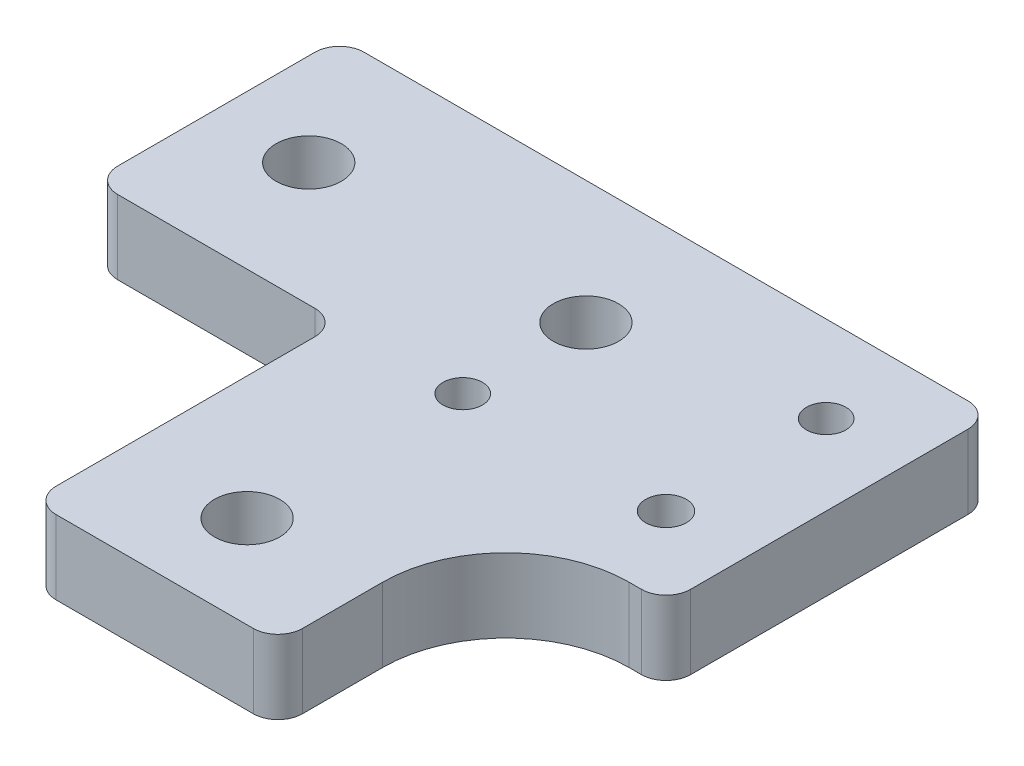
ISO-10303-21;
HEADER;
FILE_DESCRIPTION(('STEP AP214'),'2;1');
FILE_NAME('part.step','',(''),(''),'','','');
FILE_SCHEMA(('AUTOMOTIVE_DESIGN { 1 0 10303 214 1 1 1 1 }'));
ENDSEC;
DATA;
#1=APPLICATION_CONTEXT('core data for automotive mechanical design processes');
#2=APPLICATION_PROTOCOL_DEFINITION('international standard','automotive_design',2000,#1);
#3=PRODUCT_CONTEXT('',#1,'mechanical');
#4=PRODUCT('Part','Part','',(#3));
#5=PRODUCT_RELATED_PRODUCT_CATEGORY('part','',(#4));
#6=PRODUCT_DEFINITION_FORMATION('','',#4);
#7=PRODUCT_DEFINITION_CONTEXT('part definition',#1,'design');
#8=PRODUCT_DEFINITION('design','',#6,#7);
#9=PRODUCT_DEFINITION_SHAPE('','',#8);
#10=(LENGTH_UNIT() NAMED_UNIT(*) SI_UNIT(.MILLI.,.METRE.));
#11=(NAMED_UNIT(*) PLANE_ANGLE_UNIT() SI_UNIT($,.RADIAN.));
#12=(NAMED_UNIT(*) SI_UNIT($,.STERADIAN.) SOLID_ANGLE_UNIT());
#13=UNCERTAINTY_MEASURE_WITH_UNIT(LENGTH_MEASURE(1.E-05),#10,'distance_accuracy_value','');
#14=(GEOMETRIC_REPRESENTATION_CONTEXT(3) GLOBAL_UNCERTAINTY_ASSIGNED_CONTEXT((#13)) GLOBAL_UNIT_ASSIGNED_CONTEXT((#10,
#11,#12)) REPRESENTATION_CONTEXT('',''));
#15=CARTESIAN_POINT('',(0.,0.,0.));
#16=DIRECTION('',(0.,0.,1.));
#17=DIRECTION('',(1.,0.,0.));
#18=AXIS2_PLACEMENT_3D('',#15,#16,#17);
#19=CARTESIAN_POINT('',(50.,0.,-8.53727598566309));
#20=DIRECTION('',(0.,1.,0.));
#21=DIRECTION('',(0.,0.,1.));
#22=AXIS2_PLACEMENT_3D('',#19,#20,#21);
#23=PLANE('',#22);
#24=CARTESIAN_POINT('',(46.5,0.,-25.0372759856631));
#25=DIRECTION('',(0.,-1.,0.));
#26=DIRECTION('',(0.,0.,-1.));
#27=AXIS2_PLACEMENT_3D('',#24,#25,#26);
#28=CIRCLE('',#27,1.64999999999999);
#29=CARTESIAN_POINT('',(46.5,0.,-26.6872759856631));
#30=VERTEX_POINT('',#29);
#31=EDGE_CURVE('E431',#30,#30,#28,.T.);
#32=ORIENTED_EDGE('',*,*,#31,.F.);
#33=EDGE_LOOP('',(#32));
#34=FACE_BOUND('',#33,.T.);
#35=CARTESIAN_POINT('',(30.,0.,-25.0372759856631));
#36=DIRECTION('',(0.,-1.,0.));
#37=DIRECTION('',(0.,0.,-1.));
#38=AXIS2_PLACEMENT_3D('',#35,#36,#37);
#39=CIRCLE('',#38,1.6);
#40=CARTESIAN_POINT('',(30.,0.,-26.6372759856631));
#41=VERTEX_POINT('',#40);
#42=EDGE_CURVE('E435',#41,#41,#39,.T.);
#43=ORIENTED_EDGE('',*,*,#42,.F.);
#44=EDGE_LOOP('',(#43));
#45=FACE_BOUND('',#44,.T.);
#46=CARTESIAN_POINT('',(46.5,0.,-38.0372759856631));
#47=DIRECTION('',(0.,-1.,0.));
#48=DIRECTION('',(0.,0.,-1.));
#49=AXIS2_PLACEMENT_3D('',#46,#47,#48);
#50=CIRCLE('',#49,1.6);
#51=CARTESIAN_POINT('',(46.5,0.,-39.6372759856631));
#52=VERTEX_POINT('',#51);
#53=EDGE_CURVE('E445',#52,#52,#50,.T.);
#54=ORIENTED_EDGE('',*,*,#53,.F.);
#55=EDGE_LOOP('',(#54));
#56=FACE_BOUND('',#55,.T.);
#57=CARTESIAN_POINT('',(7.5,0.,-35.0372759856631));
#58=DIRECTION('',(0.,-1.,0.));
#59=DIRECTION('',(0.,0.,-1.));
#60=AXIS2_PLACEMENT_3D('',#57,#58,#59);
#61=CIRCLE('',#60,2.64999999999999);
#62=CARTESIAN_POINT('',(7.5,0.,-37.6872759856631));
#63=VERTEX_POINT('',#62);
#64=EDGE_CURVE('E453',#63,#63,#61,.T.);
#65=ORIENTED_EDGE('',*,*,#64,.F.);
#66=EDGE_LOOP('',(#65));
#67=FACE_BOUND('',#66,.T.);
#68=CARTESIAN_POINT('',(30.,0.,-35.0372759856631));
#69=DIRECTION('',(0.,-1.,0.));
#70=DIRECTION('',(0.,0.,-1.));
#71=AXIS2_PLACEMENT_3D('',#68,#69,#70);
#72=CIRCLE('',#71,2.64999999999999);
#73=CARTESIAN_POINT('',(30.,0.,-37.6872759856631));
#74=VERTEX_POINT('',#73);
#75=EDGE_CURVE('E461',#74,#74,#72,.T.);
#76=ORIENTED_EDGE('',*,*,#75,.F.);
#77=EDGE_LOOP('',(#76));
#78=FACE_BOUND('',#77,.T.);
#79=CARTESIAN_POINT('',(50.,0.,-8.53727598566309));
#80=DIRECTION('',(0.,-1.,0.));
#81=DIRECTION('',(0.,0.,1.));
#82=AXIS2_PLACEMENT_3D('',#79,#80,#81);
#83=CIRCLE('',#82,10.);
#84=CARTESIAN_POINT('',(40.,0.,-8.53727598566301));
#85=VERTEX_POINT('',#84);
#86=CARTESIAN_POINT('',(50.0000000000001,0.,-18.5372759856631));
#87=VERTEX_POINT('',#86);
#88=EDGE_CURVE('E223',#85,#87,#83,.T.);
#89=ORIENTED_EDGE('',*,*,#88,.F.);
#90=DIRECTION('',(0.,0.,-1.));
#91=VECTOR('',#90,1.);
#92=CARTESIAN_POINT('',(40.,0.,-2.0372759856631));
#93=LINE('',#92,#91);
#94=CARTESIAN_POINT('',(40.,0.,-2.0372759856631));
#95=VERTEX_POINT('',#94);
#96=EDGE_CURVE('E141',#95,#85,#93,.T.);
#97=ORIENTED_EDGE('',*,*,#96,.F.);
#98=CARTESIAN_POINT('',(38.,0.,-2.03727598566308));
#99=DIRECTION('',(0.,1.,0.));
#100=DIRECTION('',(0.,0.,1.));
#101=AXIS2_PLACEMENT_3D('',#98,#99,#100);
#102=CIRCLE('',#101,2.);
#103=CARTESIAN_POINT('',(38.,0.,-0.0372759856630822));
#104=VERTEX_POINT('',#103);
#105=EDGE_CURVE('E133',#104,#95,#102,.T.);
#106=ORIENTED_EDGE('',*,*,#105,.F.);
#107=DIRECTION('',(1.,0.,0.));
#108=VECTOR('',#107,1.);
#109=CARTESIAN_POINT('',(22.,0.,-0.0372759856630822));
#110=LINE('',#109,#108);
#111=CARTESIAN_POINT('',(22.,0.,-0.0372759856630826));
#112=VERTEX_POINT('',#111);
#113=EDGE_CURVE('E210',#112,#104,#110,.T.);
#114=ORIENTED_EDGE('',*,*,#113,.F.);
#115=CARTESIAN_POINT('',(22.,0.,-2.03727598566308));
#116=DIRECTION('',(0.,1.,0.));
#117=DIRECTION('',(0.,0.,-1.));
#118=AXIS2_PLACEMENT_3D('',#115,#116,#117);
#119=CIRCLE('',#118,2.);
#120=CARTESIAN_POINT('',(20.,0.,-2.0372759856631));
#121=VERTEX_POINT('',#120);
#122=EDGE_CURVE('E261',#121,#112,#119,.T.);
#123=ORIENTED_EDGE('',*,*,#122,.F.);
#124=DIRECTION('',(0.,0.,1.));
#125=VECTOR('',#124,1.);
#126=CARTESIAN_POINT('',(20.,0.,-2.0372759856631));
#127=LINE('',#126,#125);
#128=CARTESIAN_POINT('',(20.,0.,-23.0372759856631));
#129=VERTEX_POINT('',#128);
#130=EDGE_CURVE('E258',#129,#121,#127,.T.);
#131=ORIENTED_EDGE('',*,*,#130,.F.);
#132=CARTESIAN_POINT('',(18.,0.,-23.0372759856631));
#133=DIRECTION('',(0.,-1.,0.));
#134=DIRECTION('',(0.,0.,-1.));
#135=AXIS2_PLACEMENT_3D('',#132,#133,#134);
#136=CIRCLE('',#135,2.);
#137=CARTESIAN_POINT('',(18.,0.,-25.0372759856631));
#138=VERTEX_POINT('',#137);
#139=EDGE_CURVE('E255',#138,#129,#136,.T.);
#140=ORIENTED_EDGE('',*,*,#139,.F.);
#141=DIRECTION('',(1.,0.,0.));
#142=VECTOR('',#141,1.);
#143=CARTESIAN_POINT('',(2.00000000000003,0.,-25.0372759856631));
#144=LINE('',#143,#142);
#145=CARTESIAN_POINT('',(2.00000000000001,0.,-25.0372759856631));
#146=VERTEX_POINT('',#145);
#147=EDGE_CURVE('E252',#146,#138,#144,.T.);
#148=ORIENTED_EDGE('',*,*,#147,.F.);
#149=CARTESIAN_POINT('',(2.00000000000001,0.,-27.0372759856631));
#150=DIRECTION('',(0.,1.,0.));
#151=DIRECTION('',(0.,0.,1.));
#152=AXIS2_PLACEMENT_3D('',#149,#150,#151);
#153=CIRCLE('',#152,2.);
#154=CARTESIAN_POINT('',(0.,0.,-27.0372759856631));
#155=VERTEX_POINT('',#154);
#156=EDGE_CURVE('E249',#155,#146,#153,.T.);
#157=ORIENTED_EDGE('',*,*,#156,.F.);
#158=DIRECTION('',(0.,0.,1.));
#159=VECTOR('',#158,1.);
#160=CARTESIAN_POINT('',(0.,0.,-27.0372759856631));
#161=LINE('',#160,#159);
#162=CARTESIAN_POINT('',(0.,0.,-43.0372759856631));
#163=VERTEX_POINT('',#162);
#164=EDGE_CURVE('E246',#163,#155,#161,.T.);
#165=ORIENTED_EDGE('',*,*,#164,.F.);
#166=CARTESIAN_POINT('',(2.00000000000001,0.,-43.0372759856631));
#167=DIRECTION('',(0.,1.,0.));
#168=DIRECTION('',(0.,0.,-1.));
#169=AXIS2_PLACEMENT_3D('',#166,#167,#168);
#170=CIRCLE('',#169,2.);
#171=CARTESIAN_POINT('',(2.00000000000003,0.,-45.0372759856631));
#172=VERTEX_POINT('',#171);
#173=EDGE_CURVE('E243',#172,#163,#170,.T.);
#174=ORIENTED_EDGE('',*,*,#173,.F.);
#175=DIRECTION('',(-1.,0.,0.));
#176=VECTOR('',#175,1.);
#177=CARTESIAN_POINT('',(2.00000000000003,0.,-45.0372759856631));
#178=LINE('',#177,#176);
#179=CARTESIAN_POINT('',(51.,0.,-45.0372759856631));
#180=VERTEX_POINT('',#179);
#181=EDGE_CURVE('E240',#180,#172,#178,.T.);
#182=ORIENTED_EDGE('',*,*,#181,.F.);
#183=CARTESIAN_POINT('',(51.,0.,-43.0372759856631));
#184=DIRECTION('',(0.,1.,0.));
#185=DIRECTION('',(0.,0.,-1.));
#186=AXIS2_PLACEMENT_3D('',#183,#184,#185);
#187=CIRCLE('',#186,2.);
#188=CARTESIAN_POINT('',(53.,0.,-43.0372759856631));
#189=VERTEX_POINT('',#188);
#190=EDGE_CURVE('E237',#189,#180,#187,.T.);
#191=ORIENTED_EDGE('',*,*,#190,.F.);
#192=DIRECTION('',(0.,0.,-1.));
#193=VECTOR('',#192,1.);
#194=CARTESIAN_POINT('',(53.,0.,-20.5372759856631));
#195=LINE('',#194,#193);
#196=CARTESIAN_POINT('',(53.,0.,-20.5372759856631));
#197=VERTEX_POINT('',#196);
#198=EDGE_CURVE('E234',#197,#189,#195,.T.);
#199=ORIENTED_EDGE('',*,*,#198,.F.);
#200=CARTESIAN_POINT('',(51.,0.,-20.5372759856631));
#201=DIRECTION('',(0.,1.,0.));
#202=DIRECTION('',(0.,0.,-1.));
#203=AXIS2_PLACEMENT_3D('',#200,#201,#202);
#204=CIRCLE('',#203,2.);
#205=CARTESIAN_POINT('',(51.,0.,-18.5372759856631));
#206=VERTEX_POINT('',#205);
#207=EDGE_CURVE('E231',#206,#197,#204,.T.);
#208=ORIENTED_EDGE('',*,*,#207,.F.);
#209=DIRECTION('',(1.,0.,0.));
#210=VECTOR('',#209,1.);
#211=CARTESIAN_POINT('',(51.,0.,-18.5372759856631));
#212=LINE('',#211,#210);
#213=EDGE_CURVE('E227',#87,#206,#212,.T.);
#214=ORIENTED_EDGE('',*,*,#213,.F.);
#215=EDGE_LOOP('',(#89,#97,#106,#114,#123,#131,#140,#148,#157,#165,#174,#182,#191,#199,#208,#214));
#216=FACE_BOUND('',#215,.T.);
#217=CARTESIAN_POINT('',(30.,0.,-7.53727598566308));
#218=DIRECTION('',(0.,-1.,0.));
#219=DIRECTION('',(0.,0.,-1.));
#220=AXIS2_PLACEMENT_3D('',#217,#218,#219);
#221=CIRCLE('',#220,2.64999999999999);
#222=CARTESIAN_POINT('',(30.,0.,-10.1872759856631));
#223=VERTEX_POINT('',#222);
#224=EDGE_CURVE('E469',#223,#223,#221,.T.);
#225=ORIENTED_EDGE('',*,*,#224,.F.);
#226=EDGE_LOOP('',(#225));
#227=FACE_BOUND('',#226,.T.);
#228=ADVANCED_FACE('F47',(#34,#45,#56,#67,#78,#216,#227),#23,.F.);
#229=CARTESIAN_POINT('',(50.,6.,-8.53727598566309));
#230=DIRECTION('',(0.,-1.,0.));
#231=DIRECTION('',(0.,0.,-1.));
#232=AXIS2_PLACEMENT_3D('',#229,#230,#231);
#233=CYLINDRICAL_SURFACE('',#232,10.);
#234=ORIENTED_EDGE('',*,*,#88,.T.);
#235=DIRECTION('',(0.,-1.,0.));
#236=VECTOR('',#235,1.);
#237=CARTESIAN_POINT('',(50.0000000000001,6.,-18.5372759856631));
#238=LINE('',#237,#236);
#239=CARTESIAN_POINT('',(50.0000000000001,6.,-18.5372759856631));
#240=VERTEX_POINT('',#239);
#241=EDGE_CURVE('E11',#240,#87,#238,.T.);
#242=ORIENTED_EDGE('',*,*,#241,.F.);
#243=CARTESIAN_POINT('',(50.,6.,-8.53727598566309));
#244=DIRECTION('',(0.,-1.,0.));
#245=DIRECTION('',(0.,0.,1.));
#246=AXIS2_PLACEMENT_3D('',#243,#244,#245);
#247=CIRCLE('',#246,10.);
#248=CARTESIAN_POINT('',(40.,6.,-8.53727598566301));
#249=VERTEX_POINT('',#248);
#250=EDGE_CURVE('E270',#249,#240,#247,.T.);
#251=ORIENTED_EDGE('',*,*,#250,.F.);
#252=DIRECTION('',(0.,-1.,0.));
#253=VECTOR('',#252,1.);
#254=CARTESIAN_POINT('',(40.,6.,-8.53727598566301));
#255=LINE('',#254,#253);
#256=EDGE_CURVE('E219',#249,#85,#255,.T.);
#257=ORIENTED_EDGE('',*,*,#256,.T.);
#258=EDGE_LOOP('',(#234,#242,#251,#257));
#259=FACE_BOUND('',#258,.T.);
#260=ADVANCED_FACE('F49',(#259),#233,.F.);
#261=CARTESIAN_POINT('',(51.,6.,-18.5372759856631));
#262=DIRECTION('',(0.,0.,-1.));
#263=DIRECTION('',(-1.,0.,0.));
#264=AXIS2_PLACEMENT_3D('',#261,#262,#263);
#265=PLANE('',#264);
#266=ORIENTED_EDGE('',*,*,#213,.T.);
#267=DIRECTION('',(0.,-1.,0.));
#268=VECTOR('',#267,1.);
#269=CARTESIAN_POINT('',(51.,6.,-18.5372759856631));
#270=LINE('',#269,#268);
#271=CARTESIAN_POINT('',(51.,6.,-18.5372759856631));
#272=VERTEX_POINT('',#271);
#273=EDGE_CURVE('E57',#272,#206,#270,.T.);
#274=ORIENTED_EDGE('',*,*,#273,.F.);
#275=DIRECTION('',(1.,0.,0.));
#276=VECTOR('',#275,1.);
#277=CARTESIAN_POINT('',(51.,6.,-18.5372759856631));
#278=LINE('',#277,#276);
#279=EDGE_CURVE('E150',#240,#272,#278,.T.);
#280=ORIENTED_EDGE('',*,*,#279,.F.);
#281=ORIENTED_EDGE('',*,*,#241,.T.);
#282=EDGE_LOOP('',(#266,#274,#280,#281));
#283=FACE_BOUND('',#282,.T.);
#284=ADVANCED_FACE('F398',(#283),#265,.F.);
#285=CARTESIAN_POINT('',(51.,6.,-20.5372759856631));
#286=DIRECTION('',(0.,-1.,0.));
#287=DIRECTION('',(0.,0.,-1.));
#288=AXIS2_PLACEMENT_3D('',#285,#286,#287);
#289=CYLINDRICAL_SURFACE('',#288,2.);
#290=ORIENTED_EDGE('',*,*,#207,.T.);
#291=DIRECTION('',(0.,-1.,0.));
#292=VECTOR('',#291,1.);
#293=CARTESIAN_POINT('',(53.,6.,-20.5372759856631));
#294=LINE('',#293,#292);
#295=CARTESIAN_POINT('',(53.,6.,-20.5372759856631));
#296=VERTEX_POINT('',#295);
#297=EDGE_CURVE('E313',#296,#197,#294,.T.);
#298=ORIENTED_EDGE('',*,*,#297,.F.);
#299=CARTESIAN_POINT('',(51.,6.,-20.5372759856631));
#300=DIRECTION('',(0.,1.,0.));
#301=DIRECTION('',(0.,0.,-1.));
#302=AXIS2_PLACEMENT_3D('',#299,#300,#301);
#303=CIRCLE('',#302,2.);
#304=EDGE_CURVE('E323',#272,#296,#303,.T.);
#305=ORIENTED_EDGE('',*,*,#304,.F.);
#306=ORIENTED_EDGE('',*,*,#273,.T.);
#307=EDGE_LOOP('',(#290,#298,#305,#306));
#308=FACE_BOUND('',#307,.T.);
#309=ADVANCED_FACE('F321',(#308),#289,.T.);
#310=CARTESIAN_POINT('',(53.,6.,-20.5372759856631));
#311=DIRECTION('',(-1.,0.,0.));
#312=DIRECTION('',(0.,0.,1.));
#313=AXIS2_PLACEMENT_3D('',#310,#311,#312);
#314=PLANE('',#313);
#315=ORIENTED_EDGE('',*,*,#198,.T.);
#316=DIRECTION('',(0.,-1.,0.));
#317=VECTOR('',#316,1.);
#318=CARTESIAN_POINT('',(53.,6.,-43.0372759856631));
#319=LINE('',#318,#317);
#320=CARTESIAN_POINT('',(53.,6.,-43.0372759856631));
#321=VERTEX_POINT('',#320);
#322=EDGE_CURVE('E309',#321,#189,#319,.T.);
#323=ORIENTED_EDGE('',*,*,#322,.F.);
#324=DIRECTION('',(0.,0.,-1.));
#325=VECTOR('',#324,1.);
#326=CARTESIAN_POINT('',(53.,6.,-20.5372759856631));
#327=LINE('',#326,#325);
#328=EDGE_CURVE('E342',#296,#321,#327,.T.);
#329=ORIENTED_EDGE('',*,*,#328,.F.);
#330=ORIENTED_EDGE('',*,*,#297,.T.);
#331=EDGE_LOOP('',(#315,#323,#329,#330));
#332=FACE_BOUND('',#331,.T.);
#333=ADVANCED_FACE('F332',(#332),#314,.F.);
#334=CARTESIAN_POINT('',(51.,6.,-43.0372759856631));
#335=DIRECTION('',(0.,-1.,0.));
#336=DIRECTION('',(0.,0.,-1.));
#337=AXIS2_PLACEMENT_3D('',#334,#335,#336);
#338=CYLINDRICAL_SURFACE('',#337,2.);
#339=ORIENTED_EDGE('',*,*,#190,.T.);
#340=DIRECTION('',(0.,-1.,0.));
#341=VECTOR('',#340,1.);
#342=CARTESIAN_POINT('',(51.,6.,-45.0372759856631));
#343=LINE('',#342,#341);
#344=CARTESIAN_POINT('',(51.,6.,-45.0372759856631));
#345=VERTEX_POINT('',#344);
#346=EDGE_CURVE('E305',#345,#180,#343,.T.);
#347=ORIENTED_EDGE('',*,*,#346,.F.);
#348=CARTESIAN_POINT('',(51.,6.,-43.0372759856631));
#349=DIRECTION('',(0.,1.,0.));
#350=DIRECTION('',(0.,0.,-1.));
#351=AXIS2_PLACEMENT_3D('',#348,#349,#350);
#352=CIRCLE('',#351,2.);
#353=EDGE_CURVE('E338',#321,#345,#352,.T.);
#354=ORIENTED_EDGE('',*,*,#353,.F.);
#355=ORIENTED_EDGE('',*,*,#322,.T.);
#356=EDGE_LOOP('',(#339,#347,#354,#355));
#357=FACE_BOUND('',#356,.T.);
#358=ADVANCED_FACE('F336',(#357),#338,.T.);
#359=CARTESIAN_POINT('',(2.00000000000003,6.,-45.0372759856631));
#360=DIRECTION('',(0.,0.,1.));
#361=DIRECTION('',(1.,0.,0.));
#362=AXIS2_PLACEMENT_3D('',#359,#360,#361);
#363=PLANE('',#362);
#364=ORIENTED_EDGE('',*,*,#181,.T.);
#365=DIRECTION('',(0.,-1.,0.));
#366=VECTOR('',#365,1.);
#367=CARTESIAN_POINT('',(2.00000000000003,6.,-45.0372759856631));
#368=LINE('',#367,#366);
#369=CARTESIAN_POINT('',(2.00000000000003,6.,-45.0372759856631));
#370=VERTEX_POINT('',#369);
#371=EDGE_CURVE('E301',#370,#172,#368,.T.);
#372=ORIENTED_EDGE('',*,*,#371,.F.);
#373=DIRECTION('',(-1.,0.,0.));
#374=VECTOR('',#373,1.);
#375=CARTESIAN_POINT('',(2.00000000000003,6.,-45.0372759856631));
#376=LINE('',#375,#374);
#377=EDGE_CURVE('E341',#345,#370,#376,.T.);
#378=ORIENTED_EDGE('',*,*,#377,.F.);
#379=ORIENTED_EDGE('',*,*,#346,.T.);
#380=EDGE_LOOP('',(#364,#372,#378,#379));
#381=FACE_BOUND('',#380,.T.);
#382=ADVANCED_FACE('F596',(#381),#363,.F.);
#383=CARTESIAN_POINT('',(2.00000000000001,6.,-43.0372759856631));
#384=DIRECTION('',(0.,-1.,0.));
#385=DIRECTION('',(0.,0.,-1.));
#386=AXIS2_PLACEMENT_3D('',#383,#384,#385);
#387=CYLINDRICAL_SURFACE('',#386,2.);
#388=ORIENTED_EDGE('',*,*,#173,.T.);
#389=DIRECTION('',(0.,-1.,0.));
#390=VECTOR('',#389,1.);
#391=CARTESIAN_POINT('',(0.,6.,-43.0372759856631));
#392=LINE('',#391,#390);
#393=CARTESIAN_POINT('',(0.,6.,-43.0372759856631));
#394=VERTEX_POINT('',#393);
#395=EDGE_CURVE('E297',#394,#163,#392,.T.);
#396=ORIENTED_EDGE('',*,*,#395,.F.);
#397=CARTESIAN_POINT('',(2.00000000000001,6.,-43.0372759856631));
#398=DIRECTION('',(0.,1.,0.));
#399=DIRECTION('',(0.,0.,-1.));
#400=AXIS2_PLACEMENT_3D('',#397,#398,#399);
#401=CIRCLE('',#400,2.);
#402=EDGE_CURVE('E346',#370,#394,#401,.T.);
#403=ORIENTED_EDGE('',*,*,#402,.F.);
#404=ORIENTED_EDGE('',*,*,#371,.T.);
#405=EDGE_LOOP('',(#388,#396,#403,#404));
#406=FACE_BOUND('',#405,.T.);
#407=ADVANCED_FACE('F587',(#406),#387,.T.);
#408=CARTESIAN_POINT('',(0.,6.,-27.0372759856631));
#409=DIRECTION('',(1.,0.,0.));
#410=DIRECTION('',(0.,0.,-1.));
#411=AXIS2_PLACEMENT_3D('',#408,#409,#410);
#412=PLANE('',#411);
#413=ORIENTED_EDGE('',*,*,#164,.T.);
#414=DIRECTION('',(0.,-1.,0.));
#415=VECTOR('',#414,1.);
#416=CARTESIAN_POINT('',(0.,6.,-27.0372759856631));
#417=LINE('',#416,#415);
#418=CARTESIAN_POINT('',(0.,6.,-27.0372759856631));
#419=VERTEX_POINT('',#418);
#420=EDGE_CURVE('E293',#419,#155,#417,.T.);
#421=ORIENTED_EDGE('',*,*,#420,.F.);
#422=DIRECTION('',(0.,0.,1.));
#423=VECTOR('',#422,1.);
#424=CARTESIAN_POINT('',(0.,6.,-27.0372759856631));
#425=LINE('',#424,#423);
#426=EDGE_CURVE('E353',#394,#419,#425,.T.);
#427=ORIENTED_EDGE('',*,*,#426,.F.);
#428=ORIENTED_EDGE('',*,*,#395,.T.);
#429=EDGE_LOOP('',(#413,#421,#427,#428));
#430=FACE_BOUND('',#429,.T.);
#431=ADVANCED_FACE('F578',(#430),#412,.F.);
#432=CARTESIAN_POINT('',(2.00000000000001,6.,-27.0372759856631));
#433=DIRECTION('',(0.,-1.,0.));
#434=DIRECTION('',(0.,0.,-1.));
#435=AXIS2_PLACEMENT_3D('',#432,#433,#434);
#436=CYLINDRICAL_SURFACE('',#435,2.);
#437=ORIENTED_EDGE('',*,*,#156,.T.);
#438=DIRECTION('',(0.,-1.,0.));
#439=VECTOR('',#438,1.);
#440=CARTESIAN_POINT('',(2.00000000000001,6.,-25.0372759856631));
#441=LINE('',#440,#439);
#442=CARTESIAN_POINT('',(2.00000000000001,6.,-25.0372759856631));
#443=VERTEX_POINT('',#442);
#444=EDGE_CURVE('E289',#443,#146,#441,.T.);
#445=ORIENTED_EDGE('',*,*,#444,.F.);
#446=CARTESIAN_POINT('',(2.00000000000001,6.,-27.0372759856631));
#447=DIRECTION('',(0.,1.,0.));
#448=DIRECTION('',(0.,0.,1.));
#449=AXIS2_PLACEMENT_3D('',#446,#447,#448);
#450=CIRCLE('',#449,2.);
#451=EDGE_CURVE('E356',#419,#443,#450,.T.);
#452=ORIENTED_EDGE('',*,*,#451,.F.);
#453=ORIENTED_EDGE('',*,*,#420,.T.);
#454=EDGE_LOOP('',(#437,#445,#452,#453));
#455=FACE_BOUND('',#454,.T.);
#456=ADVANCED_FACE('F569',(#455),#436,.T.);
#457=CARTESIAN_POINT('',(2.00000000000003,6.,-25.0372759856631));
#458=DIRECTION('',(0.,0.,-1.));
#459=DIRECTION('',(-1.,0.,0.));
#460=AXIS2_PLACEMENT_3D('',#457,#458,#459);
#461=PLANE('',#460);
#462=ORIENTED_EDGE('',*,*,#147,.T.);
#463=DIRECTION('',(0.,-1.,0.));
#464=VECTOR('',#463,1.);
#465=CARTESIAN_POINT('',(18.,6.,-25.0372759856631));
#466=LINE('',#465,#464);
#467=CARTESIAN_POINT('',(18.,6.,-25.0372759856631));
#468=VERTEX_POINT('',#467);
#469=EDGE_CURVE('E285',#468,#138,#466,.T.);
#470=ORIENTED_EDGE('',*,*,#469,.F.);
#471=DIRECTION('',(1.,0.,0.));
#472=VECTOR('',#471,1.);
#473=CARTESIAN_POINT('',(2.00000000000003,6.,-25.0372759856631));
#474=LINE('',#473,#472);
#475=EDGE_CURVE('E359',#443,#468,#474,.T.);
#476=ORIENTED_EDGE('',*,*,#475,.F.);
#477=ORIENTED_EDGE('',*,*,#444,.T.);
#478=EDGE_LOOP('',(#462,#470,#476,#477));
#479=FACE_BOUND('',#478,.T.);
#480=ADVANCED_FACE('F560',(#479),#461,.F.);
#481=CARTESIAN_POINT('',(18.,6.,-23.0372759856631));
#482=DIRECTION('',(0.,-1.,0.));
#483=DIRECTION('',(0.,0.,-1.));
#484=AXIS2_PLACEMENT_3D('',#481,#482,#483);
#485=CYLINDRICAL_SURFACE('',#484,2.);
#486=ORIENTED_EDGE('',*,*,#139,.T.);
#487=DIRECTION('',(0.,-1.,0.));
#488=VECTOR('',#487,1.);
#489=CARTESIAN_POINT('',(20.,6.,-23.0372759856631));
#490=LINE('',#489,#488);
#491=CARTESIAN_POINT('',(20.,6.,-23.0372759856631));
#492=VERTEX_POINT('',#491);
#493=EDGE_CURVE('E281',#492,#129,#490,.T.);
#494=ORIENTED_EDGE('',*,*,#493,.F.);
#495=CARTESIAN_POINT('',(18.,6.,-23.0372759856631));
#496=DIRECTION('',(0.,-1.,0.));
#497=DIRECTION('',(0.,0.,-1.));
#498=AXIS2_PLACEMENT_3D('',#495,#496,#497);
#499=CIRCLE('',#498,2.);
#500=EDGE_CURVE('E362',#468,#492,#499,.T.);
#501=ORIENTED_EDGE('',*,*,#500,.F.);
#502=ORIENTED_EDGE('',*,*,#469,.T.);
#503=EDGE_LOOP('',(#486,#494,#501,#502));
#504=FACE_BOUND('',#503,.T.);
#505=ADVANCED_FACE('F552',(#504),#485,.F.);
#506=CARTESIAN_POINT('',(20.,6.,-2.0372759856631));
#507=DIRECTION('',(1.,0.,0.));
#508=DIRECTION('',(0.,0.,-1.));
#509=AXIS2_PLACEMENT_3D('',#506,#507,#508);
#510=PLANE('',#509);
#511=ORIENTED_EDGE('',*,*,#130,.T.);
#512=DIRECTION('',(0.,-1.,0.));
#513=VECTOR('',#512,1.);
#514=CARTESIAN_POINT('',(20.,6.,-2.0372759856631));
#515=LINE('',#514,#513);
#516=CARTESIAN_POINT('',(20.,6.,-2.0372759856631));
#517=VERTEX_POINT('',#516);
#518=EDGE_CURVE('E277',#517,#121,#515,.T.);
#519=ORIENTED_EDGE('',*,*,#518,.F.);
#520=DIRECTION('',(0.,0.,1.));
#521=VECTOR('',#520,1.);
#522=CARTESIAN_POINT('',(20.,6.,-2.0372759856631));
#523=LINE('',#522,#521);
#524=EDGE_CURVE('E365',#492,#517,#523,.T.);
#525=ORIENTED_EDGE('',*,*,#524,.F.);
#526=ORIENTED_EDGE('',*,*,#493,.T.);
#527=EDGE_LOOP('',(#511,#519,#525,#526));
#528=FACE_BOUND('',#527,.T.);
#529=ADVANCED_FACE('F373',(#528),#510,.F.);
#530=CARTESIAN_POINT('',(22.,6.,-2.03727598566308));
#531=DIRECTION('',(0.,-1.,0.));
#532=DIRECTION('',(0.,0.,-1.));
#533=AXIS2_PLACEMENT_3D('',#530,#531,#532);
#534=CYLINDRICAL_SURFACE('',#533,2.);
#535=ORIENTED_EDGE('',*,*,#122,.T.);
#536=DIRECTION('',(0.,-1.,0.));
#537=VECTOR('',#536,1.);
#538=CARTESIAN_POINT('',(22.,6.,-0.0372759856630826));
#539=LINE('',#538,#537);
#540=CARTESIAN_POINT('',(22.,6.,-0.0372759856630826));
#541=VERTEX_POINT('',#540);
#542=EDGE_CURVE('E212',#541,#112,#539,.T.);
#543=ORIENTED_EDGE('',*,*,#542,.F.);
#544=CARTESIAN_POINT('',(22.,6.,-2.03727598566308));
#545=DIRECTION('',(0.,1.,0.));
#546=DIRECTION('',(0.,0.,-1.));
#547=AXIS2_PLACEMENT_3D('',#544,#545,#546);
#548=CIRCLE('',#547,2.);
#549=EDGE_CURVE('E201',#517,#541,#548,.T.);
#550=ORIENTED_EDGE('',*,*,#549,.F.);
#551=ORIENTED_EDGE('',*,*,#518,.T.);
#552=EDGE_LOOP('',(#535,#543,#550,#551));
#553=FACE_BOUND('',#552,.T.);
#554=ADVANCED_FACE('F377',(#553),#534,.T.);
#555=CARTESIAN_POINT('',(22.,6.,-0.0372759856630822));
#556=DIRECTION('',(0.,0.,-1.));
#557=DIRECTION('',(-1.,0.,0.));
#558=AXIS2_PLACEMENT_3D('',#555,#556,#557);
#559=PLANE('',#558);
#560=ORIENTED_EDGE('',*,*,#113,.T.);
#561=DIRECTION('',(0.,-1.,0.));
#562=VECTOR('',#561,1.);
#563=CARTESIAN_POINT('',(38.,6.,-0.0372759856630822));
#564=LINE('',#563,#562);
#565=CARTESIAN_POINT('',(38.,6.,-0.0372759856630822));
#566=VERTEX_POINT('',#565);
#567=EDGE_CURVE('E207',#566,#104,#564,.T.);
#568=ORIENTED_EDGE('',*,*,#567,.F.);
#569=DIRECTION('',(1.,0.,0.));
#570=VECTOR('',#569,1.);
#571=CARTESIAN_POINT('',(22.,6.,-0.0372759856630822));
#572=LINE('',#571,#570);
#573=EDGE_CURVE('E195',#541,#566,#572,.T.);
#574=ORIENTED_EDGE('',*,*,#573,.F.);
#575=ORIENTED_EDGE('',*,*,#542,.T.);
#576=EDGE_LOOP('',(#560,#568,#574,#575));
#577=FACE_BOUND('',#576,.T.);
#578=ADVANCED_FACE('F208',(#577),#559,.F.);
#579=CARTESIAN_POINT('',(38.,6.,-2.03727598566308));
#580=DIRECTION('',(0.,-1.,0.));
#581=DIRECTION('',(0.,0.,-1.));
#582=AXIS2_PLACEMENT_3D('',#579,#580,#581);
#583=CYLINDRICAL_SURFACE('',#582,2.);
#584=ORIENTED_EDGE('',*,*,#105,.T.);
#585=DIRECTION('',(0.,-1.,0.));
#586=VECTOR('',#585,1.);
#587=CARTESIAN_POINT('',(40.,6.,-2.0372759856631));
#588=LINE('',#587,#586);
#589=CARTESIAN_POINT('',(40.,6.,-2.0372759856631));
#590=VERTEX_POINT('',#589);
#591=EDGE_CURVE('E213',#590,#95,#588,.T.);
#592=ORIENTED_EDGE('',*,*,#591,.F.);
#593=CARTESIAN_POINT('',(38.,6.,-2.03727598566308));
#594=DIRECTION('',(0.,1.,0.));
#595=DIRECTION('',(0.,0.,1.));
#596=AXIS2_PLACEMENT_3D('',#593,#594,#595);
#597=CIRCLE('',#596,2.);
#598=EDGE_CURVE('E199',#566,#590,#597,.T.);
#599=ORIENTED_EDGE('',*,*,#598,.F.);
#600=ORIENTED_EDGE('',*,*,#567,.T.);
#601=EDGE_LOOP('',(#584,#592,#599,#600));
#602=FACE_BOUND('',#601,.T.);
#603=ADVANCED_FACE('F215',(#602),#583,.T.);
#604=CARTESIAN_POINT('',(40.,6.,-2.0372759856631));
#605=DIRECTION('',(-1.,0.,0.));
#606=DIRECTION('',(0.,0.,1.));
#607=AXIS2_PLACEMENT_3D('',#604,#605,#606);
#608=PLANE('',#607);
#609=ORIENTED_EDGE('',*,*,#96,.T.);
#610=ORIENTED_EDGE('',*,*,#256,.F.);
#611=DIRECTION('',(0.,0.,-1.));
#612=VECTOR('',#611,1.);
#613=CARTESIAN_POINT('',(40.,6.,-2.0372759856631));
#614=LINE('',#613,#612);
#615=EDGE_CURVE('E68',#590,#249,#614,.T.);
#616=ORIENTED_EDGE('',*,*,#615,.F.);
#617=ORIENTED_EDGE('',*,*,#591,.T.);
#618=EDGE_LOOP('',(#609,#610,#616,#617));
#619=FACE_BOUND('',#618,.T.);
#620=ADVANCED_FACE('F381',(#619),#608,.F.);
#621=CARTESIAN_POINT('',(50.,6.,-8.53727598566309));
#622=DIRECTION('',(0.,1.,0.));
#623=DIRECTION('',(0.,0.,1.));
#624=AXIS2_PLACEMENT_3D('',#621,#622,#623);
#625=PLANE('',#624);
#626=CARTESIAN_POINT('',(46.5,6.,-25.0372759856631));
#627=DIRECTION('',(0.,-1.,0.));
#628=DIRECTION('',(0.,0.,-1.));
#629=AXIS2_PLACEMENT_3D('',#626,#627,#628);
#630=CIRCLE('',#629,1.64999999999999);
#631=CARTESIAN_POINT('',(46.5,6.,-26.6872759856631));
#632=VERTEX_POINT('',#631);
#633=EDGE_CURVE('E429',#632,#632,#630,.T.);
#634=ORIENTED_EDGE('',*,*,#633,.T.);
#635=EDGE_LOOP('',(#634));
#636=FACE_BOUND('',#635,.T.);
#637=CARTESIAN_POINT('',(30.,6.,-25.0372759856631));
#638=DIRECTION('',(0.,-1.,0.));
#639=DIRECTION('',(0.,0.,-1.));
#640=AXIS2_PLACEMENT_3D('',#637,#638,#639);
#641=CIRCLE('',#640,1.59999999999999);
#642=CARTESIAN_POINT('',(30.,6.,-26.6372759856631));
#643=VERTEX_POINT('',#642);
#644=EDGE_CURVE('E441',#643,#643,#641,.T.);
#645=ORIENTED_EDGE('',*,*,#644,.T.);
#646=EDGE_LOOP('',(#645));
#647=FACE_BOUND('',#646,.T.);
#648=CARTESIAN_POINT('',(46.5,6.,-38.0372759856631));
#649=DIRECTION('',(0.,-1.,0.));
#650=DIRECTION('',(0.,0.,-1.));
#651=AXIS2_PLACEMENT_3D('',#648,#649,#650);
#652=CIRCLE('',#651,1.59999999999999);
#653=CARTESIAN_POINT('',(46.5,6.,-39.6372759856631));
#654=VERTEX_POINT('',#653);
#655=EDGE_CURVE('E449',#654,#654,#652,.T.);
#656=ORIENTED_EDGE('',*,*,#655,.T.);
#657=EDGE_LOOP('',(#656));
#658=FACE_BOUND('',#657,.T.);
#659=CARTESIAN_POINT('',(7.5,6.,-35.0372759856631));
#660=DIRECTION('',(0.,-1.,0.));
#661=DIRECTION('',(0.,0.,-1.));
#662=AXIS2_PLACEMENT_3D('',#659,#660,#661);
#663=CIRCLE('',#662,2.64999999999999);
#664=CARTESIAN_POINT('',(7.5,6.,-37.6872759856631));
#665=VERTEX_POINT('',#664);
#666=EDGE_CURVE('E457',#665,#665,#663,.T.);
#667=ORIENTED_EDGE('',*,*,#666,.T.);
#668=EDGE_LOOP('',(#667));
#669=FACE_BOUND('',#668,.T.);
#670=CARTESIAN_POINT('',(30.,6.,-35.0372759856631));
#671=DIRECTION('',(0.,-1.,0.));
#672=DIRECTION('',(0.,0.,-1.));
#673=AXIS2_PLACEMENT_3D('',#670,#671,#672);
#674=CIRCLE('',#673,2.64999999999999);
#675=CARTESIAN_POINT('',(30.,6.,-37.6872759856631));
#676=VERTEX_POINT('',#675);
#677=EDGE_CURVE('E465',#676,#676,#674,.T.);
#678=ORIENTED_EDGE('',*,*,#677,.T.);
#679=EDGE_LOOP('',(#678));
#680=FACE_BOUND('',#679,.T.);
#681=CARTESIAN_POINT('',(30.,6.,-7.53727598566308));
#682=DIRECTION('',(0.,-1.,0.));
#683=DIRECTION('',(0.,0.,-1.));
#684=AXIS2_PLACEMENT_3D('',#681,#682,#683);
#685=CIRCLE('',#684,2.64999999999999);
#686=CARTESIAN_POINT('',(30.,6.,-10.1872759856631));
#687=VERTEX_POINT('',#686);
#688=EDGE_CURVE('E228',#687,#687,#685,.T.);
#689=ORIENTED_EDGE('',*,*,#688,.T.);
#690=EDGE_LOOP('',(#689));
#691=FACE_BOUND('',#690,.T.);
#692=ORIENTED_EDGE('',*,*,#250,.T.);
#693=ORIENTED_EDGE('',*,*,#279,.T.);
#694=ORIENTED_EDGE('',*,*,#304,.T.);
#695=ORIENTED_EDGE('',*,*,#328,.T.);
#696=ORIENTED_EDGE('',*,*,#353,.T.);
#697=ORIENTED_EDGE('',*,*,#377,.T.);
#698=ORIENTED_EDGE('',*,*,#402,.T.);
#699=ORIENTED_EDGE('',*,*,#426,.T.);
#700=ORIENTED_EDGE('',*,*,#451,.T.);
#701=ORIENTED_EDGE('',*,*,#475,.T.);
#702=ORIENTED_EDGE('',*,*,#500,.T.);
#703=ORIENTED_EDGE('',*,*,#524,.T.);
#704=ORIENTED_EDGE('',*,*,#549,.T.);
#705=ORIENTED_EDGE('',*,*,#573,.T.);
#706=ORIENTED_EDGE('',*,*,#598,.T.);
#707=ORIENTED_EDGE('',*,*,#615,.T.);
#708=EDGE_LOOP('',(#692,#693,#694,#695,#696,#697,#698,#699,#700,#701,#702,#703,#704,#705,#706,#707));
#709=FACE_BOUND('',#708,.T.);
#710=ADVANCED_FACE('F197',(#636,#647,#658,#669,#680,#691,#709),#625,.T.);
#711=CARTESIAN_POINT('',(30.,0.,-7.53727598566308));
#712=DIRECTION('',(0.,-1.,0.));
#713=DIRECTION('',(0.,0.,-1.));
#714=AXIS2_PLACEMENT_3D('',#711,#712,#713);
#715=CYLINDRICAL_SURFACE('',#714,2.64999999999999);
#716=ORIENTED_EDGE('',*,*,#688,.F.);
#717=EDGE_LOOP('',(#716));
#718=FACE_BOUND('',#717,.T.);
#719=ORIENTED_EDGE('',*,*,#224,.T.);
#720=EDGE_LOOP('',(#719));
#721=FACE_BOUND('',#720,.T.);
#722=ADVANCED_FACE('F388',(#718,#721),#715,.F.);
#723=CARTESIAN_POINT('',(30.,0.,-35.0372759856631));
#724=DIRECTION('',(0.,-1.,0.));
#725=DIRECTION('',(0.,0.,-1.));
#726=AXIS2_PLACEMENT_3D('',#723,#724,#725);
#727=CYLINDRICAL_SURFACE('',#726,2.64999999999999);
#728=ORIENTED_EDGE('',*,*,#677,.F.);
#729=EDGE_LOOP('',(#728));
#730=FACE_BOUND('',#729,.T.);
#731=ORIENTED_EDGE('',*,*,#75,.T.);
#732=EDGE_LOOP('',(#731));
#733=FACE_BOUND('',#732,.T.);
#734=ADVANCED_FACE('F404',(#730,#733),#727,.F.);
#735=CARTESIAN_POINT('',(7.5,0.,-35.0372759856631));
#736=DIRECTION('',(0.,-1.,0.));
#737=DIRECTION('',(0.,0.,-1.));
#738=AXIS2_PLACEMENT_3D('',#735,#736,#737);
#739=CYLINDRICAL_SURFACE('',#738,2.64999999999999);
#740=ORIENTED_EDGE('',*,*,#666,.F.);
#741=EDGE_LOOP('',(#740));
#742=FACE_BOUND('',#741,.T.);
#743=ORIENTED_EDGE('',*,*,#64,.T.);
#744=EDGE_LOOP('',(#743));
#745=FACE_BOUND('',#744,.T.);
#746=ADVANCED_FACE('F408',(#742,#745),#739,.F.);
#747=CARTESIAN_POINT('',(46.5,0.,-38.0372759856631));
#748=DIRECTION('',(0.,-1.,0.));
#749=DIRECTION('',(0.,0.,-1.));
#750=AXIS2_PLACEMENT_3D('',#747,#748,#749);
#751=CYLINDRICAL_SURFACE('',#750,1.59999999999999);
#752=ORIENTED_EDGE('',*,*,#655,.F.);
#753=EDGE_LOOP('',(#752));
#754=FACE_BOUND('',#753,.T.);
#755=ORIENTED_EDGE('',*,*,#53,.T.);
#756=EDGE_LOOP('',(#755));
#757=FACE_BOUND('',#756,.T.);
#758=ADVANCED_FACE('F412',(#754,#757),#751,.F.);
#759=CARTESIAN_POINT('',(30.,0.,-25.0372759856631));
#760=DIRECTION('',(0.,-1.,0.));
#761=DIRECTION('',(0.,0.,-1.));
#762=AXIS2_PLACEMENT_3D('',#759,#760,#761);
#763=CYLINDRICAL_SURFACE('',#762,1.59999999999999);
#764=ORIENTED_EDGE('',*,*,#644,.F.);
#765=EDGE_LOOP('',(#764));
#766=FACE_BOUND('',#765,.T.);
#767=ORIENTED_EDGE('',*,*,#42,.T.);
#768=EDGE_LOOP('',(#767));
#769=FACE_BOUND('',#768,.T.);
#770=ADVANCED_FACE('F416',(#766,#769),#763,.F.);
#771=CARTESIAN_POINT('',(46.5,0.,-25.0372759856631));
#772=DIRECTION('',(0.,-1.,0.));
#773=DIRECTION('',(0.,0.,-1.));
#774=AXIS2_PLACEMENT_3D('',#771,#772,#773);
#775=CYLINDRICAL_SURFACE('',#774,1.64999999999999);
#776=ORIENTED_EDGE('',*,*,#633,.F.);
#777=EDGE_LOOP('',(#776));
#778=FACE_BOUND('',#777,.T.);
#779=ORIENTED_EDGE('',*,*,#31,.T.);
#780=EDGE_LOOP('',(#779));
#781=FACE_BOUND('',#780,.T.);
#782=ADVANCED_FACE('F420',(#778,#781),#775,.F.);
#783=CLOSED_SHELL('',(#228,#260,#284,#309,#333,#358,#382,#407,#431,#456,#480,#505,#529,#554,
#578,#603,#620,#710,#722,#734,#746,#758,#770,#782));
#784=MANIFOLD_SOLID_BREP('B2',#783);
#785=ADVANCED_BREP_SHAPE_REPRESENTATION('',(#18,#784),#14);
#786=SHAPE_DEFINITION_REPRESENTATION(#9,#785);
ENDSEC;
END-ISO-10303-21;
